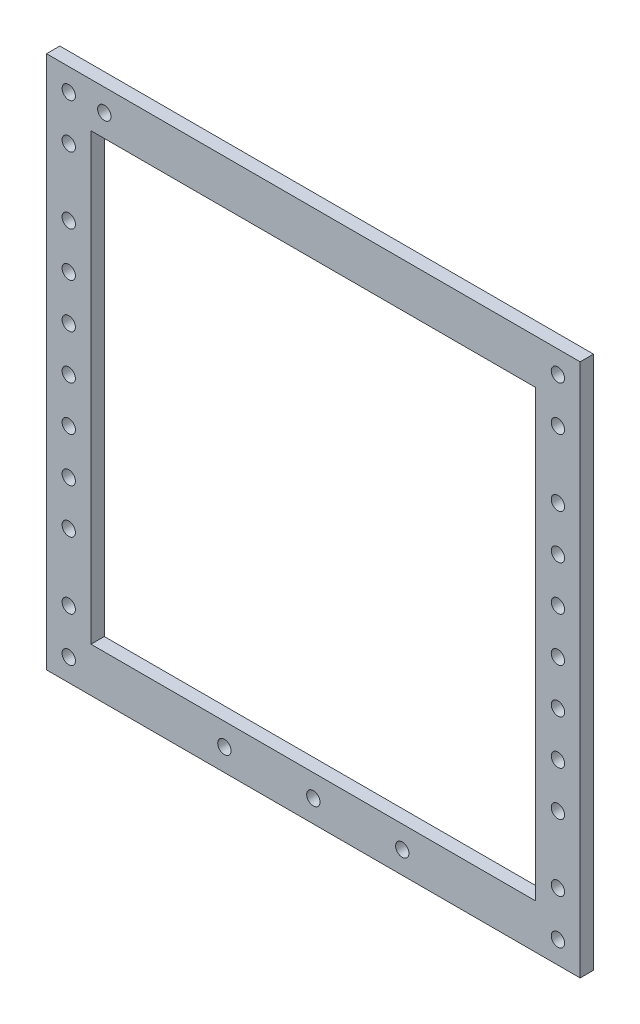
ISO-10303-21;
HEADER;
FILE_DESCRIPTION(('STEP AP214'),'2;1');
FILE_NAME('part.step','',(''),(''),'','','');
FILE_SCHEMA(('AUTOMOTIVE_DESIGN { 1 0 10303 214 1 1 1 1 }'));
ENDSEC;
DATA;
#1=APPLICATION_CONTEXT('core data for automotive mechanical design processes');
#2=APPLICATION_PROTOCOL_DEFINITION('international standard','automotive_design',2000,#1);
#3=PRODUCT_CONTEXT('',#1,'mechanical');
#4=PRODUCT('Part','Part','',(#3));
#5=PRODUCT_RELATED_PRODUCT_CATEGORY('part','',(#4));
#6=PRODUCT_DEFINITION_FORMATION('','',#4);
#7=PRODUCT_DEFINITION_CONTEXT('part definition',#1,'design');
#8=PRODUCT_DEFINITION('design','',#6,#7);
#9=PRODUCT_DEFINITION_SHAPE('','',#8);
#10=(LENGTH_UNIT() NAMED_UNIT(*) SI_UNIT(.MILLI.,.METRE.));
#11=(NAMED_UNIT(*) PLANE_ANGLE_UNIT() SI_UNIT($,.RADIAN.));
#12=(NAMED_UNIT(*) SI_UNIT($,.STERADIAN.) SOLID_ANGLE_UNIT());
#13=UNCERTAINTY_MEASURE_WITH_UNIT(LENGTH_MEASURE(1.E-05),#10,'distance_accuracy_value','');
#14=(GEOMETRIC_REPRESENTATION_CONTEXT(3) GLOBAL_UNCERTAINTY_ASSIGNED_CONTEXT((#13)) GLOBAL_UNIT_ASSIGNED_CONTEXT((#10,
#11,#12)) REPRESENTATION_CONTEXT('',''));
#15=CARTESIAN_POINT('',(0.,0.,0.));
#16=DIRECTION('',(0.,0.,1.));
#17=DIRECTION('',(1.,0.,0.));
#18=AXIS2_PLACEMENT_3D('',#15,#16,#17);
#19=CARTESIAN_POINT('',(-6.52690381404906,6.34615384615385,3.));
#20=DIRECTION('',(1.,0.,0.));
#21=DIRECTION('',(0.,1.,0.));
#22=AXIS2_PLACEMENT_3D('',#19,#20,#21);
#23=PLANE('',#22);
#24=DIRECTION('',(0.,-1.,0.));
#25=VECTOR('',#24,1.);
#26=CARTESIAN_POINT('',(-6.52690381404906,6.34615384615385,0.));
#27=LINE('',#26,#25);
#28=CARTESIAN_POINT('',(-6.52690381404906,6.34615384615385,0.));
#29=VERTEX_POINT('',#28);
#30=CARTESIAN_POINT('',(-6.52690381404904,-113.653846153846,0.));
#31=VERTEX_POINT('',#30);
#32=EDGE_CURVE('E134',#29,#31,#27,.T.);
#33=ORIENTED_EDGE('',*,*,#32,.T.);
#34=DIRECTION('',(0.,0.,-1.));
#35=VECTOR('',#34,1.);
#36=CARTESIAN_POINT('',(-6.52690381404904,-113.653846153846,3.));
#37=LINE('',#36,#35);
#38=CARTESIAN_POINT('',(-6.52690381404904,-113.653846153846,3.));
#39=VERTEX_POINT('',#38);
#40=EDGE_CURVE('E11',#39,#31,#37,.T.);
#41=ORIENTED_EDGE('',*,*,#40,.F.);
#42=DIRECTION('',(0.,-1.,0.));
#43=VECTOR('',#42,1.);
#44=CARTESIAN_POINT('',(-6.52690381404906,6.34615384615385,3.));
#45=LINE('',#44,#43);
#46=CARTESIAN_POINT('',(-6.52690381404906,6.34615384615385,3.));
#47=VERTEX_POINT('',#46);
#48=EDGE_CURVE('E138',#47,#39,#45,.T.);
#49=ORIENTED_EDGE('',*,*,#48,.F.);
#50=DIRECTION('',(0.,0.,-1.));
#51=VECTOR('',#50,1.);
#52=CARTESIAN_POINT('',(-6.52690381404906,6.34615384615385,3.));
#53=LINE('',#52,#51);
#54=EDGE_CURVE('E148',#47,#29,#53,.T.);
#55=ORIENTED_EDGE('',*,*,#54,.T.);
#56=EDGE_LOOP('',(#33,#41,#49,#55));
#57=FACE_BOUND('',#56,.T.);
#58=ADVANCED_FACE('F33',(#57),#23,.F.);
#59=CARTESIAN_POINT('',(-6.52690381404904,-113.653846153846,3.));
#60=DIRECTION('',(0.,1.,0.));
#61=DIRECTION('',(0.,0.,1.));
#62=AXIS2_PLACEMENT_3D('',#59,#60,#61);
#63=PLANE('',#62);
#64=DIRECTION('',(1.,0.,0.));
#65=VECTOR('',#64,1.);
#66=CARTESIAN_POINT('',(-6.52690381404904,-113.653846153846,0.));
#67=LINE('',#66,#65);
#68=CARTESIAN_POINT('',(113.473096185951,-113.653846153846,0.));
#69=VERTEX_POINT('',#68);
#70=EDGE_CURVE('E151',#31,#69,#67,.T.);
#71=ORIENTED_EDGE('',*,*,#70,.T.);
#72=DIRECTION('',(0.,0.,-1.));
#73=VECTOR('',#72,1.);
#74=CARTESIAN_POINT('',(113.473096185951,-113.653846153846,3.));
#75=LINE('',#74,#73);
#76=CARTESIAN_POINT('',(113.473096185951,-113.653846153846,3.));
#77=VERTEX_POINT('',#76);
#78=EDGE_CURVE('E40',#77,#69,#75,.T.);
#79=ORIENTED_EDGE('',*,*,#78,.F.);
#80=DIRECTION('',(1.,0.,0.));
#81=VECTOR('',#80,1.);
#82=CARTESIAN_POINT('',(-6.52690381404904,-113.653846153846,3.));
#83=LINE('',#82,#81);
#84=EDGE_CURVE('E141',#39,#77,#83,.T.);
#85=ORIENTED_EDGE('',*,*,#84,.F.);
#86=ORIENTED_EDGE('',*,*,#40,.T.);
#87=EDGE_LOOP('',(#71,#79,#85,#86));
#88=FACE_BOUND('',#87,.T.);
#89=ADVANCED_FACE('F179',(#88),#63,.F.);
#90=CARTESIAN_POINT('',(113.473096185951,6.34615384615385,3.));
#91=DIRECTION('',(-1.,0.,0.));
#92=DIRECTION('',(0.,-1.,0.));
#93=AXIS2_PLACEMENT_3D('',#90,#91,#92);
#94=PLANE('',#93);
#95=DIRECTION('',(0.,1.,0.));
#96=VECTOR('',#95,1.);
#97=CARTESIAN_POINT('',(113.473096185951,6.34615384615385,0.));
#98=LINE('',#97,#96);
#99=CARTESIAN_POINT('',(113.473096185951,6.34615384615385,0.));
#100=VERTEX_POINT('',#99);
#101=EDGE_CURVE('E153',#69,#100,#98,.T.);
#102=ORIENTED_EDGE('',*,*,#101,.T.);
#103=DIRECTION('',(0.,0.,-1.));
#104=VECTOR('',#103,1.);
#105=CARTESIAN_POINT('',(113.473096185951,6.34615384615385,3.));
#106=LINE('',#105,#104);
#107=CARTESIAN_POINT('',(113.473096185951,6.34615384615385,3.));
#108=VERTEX_POINT('',#107);
#109=EDGE_CURVE('E158',#108,#100,#106,.T.);
#110=ORIENTED_EDGE('',*,*,#109,.F.);
#111=DIRECTION('',(0.,1.,0.));
#112=VECTOR('',#111,1.);
#113=CARTESIAN_POINT('',(113.473096185951,6.34615384615385,3.));
#114=LINE('',#113,#112);
#115=EDGE_CURVE('E144',#77,#108,#114,.T.);
#116=ORIENTED_EDGE('',*,*,#115,.F.);
#117=ORIENTED_EDGE('',*,*,#78,.T.);
#118=EDGE_LOOP('',(#102,#110,#116,#117));
#119=FACE_BOUND('',#118,.T.);
#120=ADVANCED_FACE('F165',(#119),#94,.F.);
#121=CARTESIAN_POINT('',(-6.52690381404906,6.34615384615385,3.));
#122=DIRECTION('',(0.,-1.,0.));
#123=DIRECTION('',(0.,0.,-1.));
#124=AXIS2_PLACEMENT_3D('',#121,#122,#123);
#125=PLANE('',#124);
#126=DIRECTION('',(-1.,0.,0.));
#127=VECTOR('',#126,1.);
#128=CARTESIAN_POINT('',(-6.52690381404906,6.34615384615385,0.));
#129=LINE('',#128,#127);
#130=EDGE_CURVE('E142',#100,#29,#129,.T.);
#131=ORIENTED_EDGE('',*,*,#130,.T.);
#132=ORIENTED_EDGE('',*,*,#54,.F.);
#133=DIRECTION('',(-1.,0.,0.));
#134=VECTOR('',#133,1.);
#135=CARTESIAN_POINT('',(-6.52690381404906,6.34615384615385,3.));
#136=LINE('',#135,#134);
#137=EDGE_CURVE('E146',#108,#47,#136,.T.);
#138=ORIENTED_EDGE('',*,*,#137,.F.);
#139=ORIENTED_EDGE('',*,*,#109,.T.);
#140=EDGE_LOOP('',(#131,#132,#138,#139));
#141=FACE_BOUND('',#140,.T.);
#142=ADVANCED_FACE('F172',(#141),#125,.F.);
#143=CARTESIAN_POINT('',(0.,0.,3.));
#144=DIRECTION('',(0.,0.,1.));
#145=DIRECTION('',(1.,0.,0.));
#146=AXIS2_PLACEMENT_3D('',#143,#144,#145);
#147=PLANE('',#146);
#148=CARTESIAN_POINT('',(-1.52690381404907,-43.6538461538462,3.));
#149=DIRECTION('',(0.,0.,1.));
#150=DIRECTION('',(-1.,0.,0.));
#151=AXIS2_PLACEMENT_3D('',#148,#149,#150);
#152=CIRCLE('',#151,1.5);
#153=CARTESIAN_POINT('',(-3.02690381404907,-43.6538461538462,3.));
#154=VERTEX_POINT('',#153);
#155=EDGE_CURVE('E339',#154,#154,#152,.T.);
#156=ORIENTED_EDGE('',*,*,#155,.F.);
#157=EDGE_LOOP('',(#156));
#158=FACE_BOUND('',#157,.T.);
#159=CARTESIAN_POINT('',(-1.52690381404907,-23.6538461538462,3.));
#160=DIRECTION('',(0.,0.,1.));
#161=DIRECTION('',(-1.,0.,0.));
#162=AXIS2_PLACEMENT_3D('',#159,#160,#161);
#163=CIRCLE('',#162,1.5);
#164=CARTESIAN_POINT('',(-3.02690381404907,-23.6538461538462,3.));
#165=VERTEX_POINT('',#164);
#166=EDGE_CURVE('E345',#165,#165,#163,.T.);
#167=ORIENTED_EDGE('',*,*,#166,.F.);
#168=EDGE_LOOP('',(#167));
#169=FACE_BOUND('',#168,.T.);
#170=CARTESIAN_POINT('',(108.473096185951,-8.65384615384616,3.));
#171=DIRECTION('',(0.,0.,1.));
#172=DIRECTION('',(1.,0.,0.));
#173=AXIS2_PLACEMENT_3D('',#170,#171,#172);
#174=CIRCLE('',#173,1.5);
#175=CARTESIAN_POINT('',(109.973096185951,-8.65384615384616,3.));
#176=VERTEX_POINT('',#175);
#177=EDGE_CURVE('E321',#176,#176,#174,.T.);
#178=ORIENTED_EDGE('',*,*,#177,.F.);
#179=EDGE_LOOP('',(#178));
#180=FACE_BOUND('',#179,.T.);
#181=CARTESIAN_POINT('',(108.473096185951,-98.6538461538462,3.));
#182=DIRECTION('',(0.,0.,1.));
#183=DIRECTION('',(1.,0.,0.));
#184=AXIS2_PLACEMENT_3D('',#181,#182,#183);
#185=CIRCLE('',#184,1.5);
#186=CARTESIAN_POINT('',(109.973096185951,-98.6538461538462,3.));
#187=VERTEX_POINT('',#186);
#188=EDGE_CURVE('E317',#187,#187,#185,.T.);
#189=ORIENTED_EDGE('',*,*,#188,.F.);
#190=EDGE_LOOP('',(#189));
#191=FACE_BOUND('',#190,.T.);
#192=CARTESIAN_POINT('',(-1.52690381404905,-98.6538461538462,3.));
#193=DIRECTION('',(0.,0.,1.));
#194=DIRECTION('',(-1.,0.,0.));
#195=AXIS2_PLACEMENT_3D('',#192,#193,#194);
#196=CIRCLE('',#195,1.5);
#197=CARTESIAN_POINT('',(-3.02690381404904,-98.6538461538462,3.));
#198=VERTEX_POINT('',#197);
#199=EDGE_CURVE('E324',#198,#198,#196,.T.);
#200=ORIENTED_EDGE('',*,*,#199,.F.);
#201=EDGE_LOOP('',(#200));
#202=FACE_BOUND('',#201,.T.);
#203=CARTESIAN_POINT('',(-1.52690381404909,-8.65384615384618,3.));
#204=DIRECTION('',(0.,0.,1.));
#205=DIRECTION('',(-1.,0.,0.));
#206=AXIS2_PLACEMENT_3D('',#203,#204,#205);
#207=CIRCLE('',#206,1.5);
#208=CARTESIAN_POINT('',(-3.02690381404909,-8.65384615384618,3.));
#209=VERTEX_POINT('',#208);
#210=EDGE_CURVE('E332',#209,#209,#207,.T.);
#211=ORIENTED_EDGE('',*,*,#210,.F.);
#212=EDGE_LOOP('',(#211));
#213=FACE_BOUND('',#212,.T.);
#214=CARTESIAN_POINT('',(108.473096185951,-43.6538461538462,3.));
#215=DIRECTION('',(0.,0.,1.));
#216=DIRECTION('',(1.,0.,0.));
#217=AXIS2_PLACEMENT_3D('',#214,#215,#216);
#218=CIRCLE('',#217,1.5);
#219=CARTESIAN_POINT('',(109.973096185951,-43.6538461538462,3.));
#220=VERTEX_POINT('',#219);
#221=EDGE_CURVE('E375',#220,#220,#218,.T.);
#222=ORIENTED_EDGE('',*,*,#221,.F.);
#223=EDGE_LOOP('',(#222));
#224=FACE_BOUND('',#223,.T.);
#225=CARTESIAN_POINT('',(108.473096185951,-63.6538461538462,3.));
#226=DIRECTION('',(0.,0.,1.));
#227=DIRECTION('',(1.,0.,0.));
#228=AXIS2_PLACEMENT_3D('',#225,#226,#227);
#229=CIRCLE('',#228,1.5);
#230=CARTESIAN_POINT('',(109.973096185951,-63.6538461538462,3.));
#231=VERTEX_POINT('',#230);
#232=EDGE_CURVE('E356',#231,#231,#229,.T.);
#233=ORIENTED_EDGE('',*,*,#232,.F.);
#234=EDGE_LOOP('',(#233));
#235=FACE_BOUND('',#234,.T.);
#236=CARTESIAN_POINT('',(108.473096185951,-83.6538461538462,3.));
#237=DIRECTION('',(0.,0.,1.));
#238=DIRECTION('',(1.,0.,0.));
#239=AXIS2_PLACEMENT_3D('',#236,#237,#238);
#240=CIRCLE('',#239,1.5);
#241=CARTESIAN_POINT('',(109.973096185951,-83.6538461538462,3.));
#242=VERTEX_POINT('',#241);
#243=EDGE_CURVE('E357',#242,#242,#240,.T.);
#244=ORIENTED_EDGE('',*,*,#243,.F.);
#245=EDGE_LOOP('',(#244));
#246=FACE_BOUND('',#245,.T.);
#247=CARTESIAN_POINT('',(-1.52690381404906,-83.6538461538462,3.));
#248=DIRECTION('',(0.,0.,1.));
#249=DIRECTION('',(-1.,0.,0.));
#250=AXIS2_PLACEMENT_3D('',#247,#248,#249);
#251=CIRCLE('',#250,1.5);
#252=CARTESIAN_POINT('',(-3.02690381404906,-83.6538461538462,3.));
#253=VERTEX_POINT('',#252);
#254=EDGE_CURVE('E363',#253,#253,#251,.T.);
#255=ORIENTED_EDGE('',*,*,#254,.F.);
#256=EDGE_LOOP('',(#255));
#257=FACE_BOUND('',#256,.T.);
#258=CARTESIAN_POINT('',(-1.52690381404906,-63.6538461538462,3.));
#259=DIRECTION('',(0.,0.,1.));
#260=DIRECTION('',(-1.,0.,0.));
#261=AXIS2_PLACEMENT_3D('',#258,#259,#260);
#262=CIRCLE('',#261,1.5);
#263=CARTESIAN_POINT('',(-3.02690381404906,-63.6538461538462,3.));
#264=VERTEX_POINT('',#263);
#265=EDGE_CURVE('E338',#264,#264,#262,.T.);
#266=ORIENTED_EDGE('',*,*,#265,.F.);
#267=EDGE_LOOP('',(#266));
#268=FACE_BOUND('',#267,.T.);
#269=CARTESIAN_POINT('',(108.473096185951,-23.6538461538462,3.));
#270=DIRECTION('',(0.,0.,1.));
#271=DIRECTION('',(1.,0.,0.));
#272=AXIS2_PLACEMENT_3D('',#269,#270,#271);
#273=CIRCLE('',#272,1.5);
#274=CARTESIAN_POINT('',(109.973096185951,-23.6538461538462,3.));
#275=VERTEX_POINT('',#274);
#276=EDGE_CURVE('E374',#275,#275,#273,.T.);
#277=ORIENTED_EDGE('',*,*,#276,.F.);
#278=EDGE_LOOP('',(#277));
#279=FACE_BOUND('',#278,.T.);
#280=CARTESIAN_POINT('',(53.4730961859509,-108.653846153846,3.));
#281=DIRECTION('',(0.,0.,1.));
#282=DIRECTION('',(1.,0.,0.));
#283=AXIS2_PLACEMENT_3D('',#280,#281,#282);
#284=CIRCLE('',#283,1.5);
#285=CARTESIAN_POINT('',(54.973096185951,-108.653846153846,3.));
#286=VERTEX_POINT('',#285);
#287=EDGE_CURVE('E393',#286,#286,#284,.T.);
#288=ORIENTED_EDGE('',*,*,#287,.F.);
#289=EDGE_LOOP('',(#288));
#290=FACE_BOUND('',#289,.T.);
#291=CARTESIAN_POINT('',(33.4730961859509,-108.653846153846,3.));
#292=DIRECTION('',(0.,0.,1.));
#293=DIRECTION('',(1.,0.,0.));
#294=AXIS2_PLACEMENT_3D('',#291,#292,#293);
#295=CIRCLE('',#294,1.5);
#296=CARTESIAN_POINT('',(34.9730961859509,-108.653846153846,3.));
#297=VERTEX_POINT('',#296);
#298=EDGE_CURVE('E386',#297,#297,#295,.T.);
#299=ORIENTED_EDGE('',*,*,#298,.F.);
#300=EDGE_LOOP('',(#299));
#301=FACE_BOUND('',#300,.T.);
#302=CARTESIAN_POINT('',(73.4730961859509,-108.653846153846,3.));
#303=DIRECTION('',(0.,0.,1.));
#304=DIRECTION('',(1.,0.,0.));
#305=AXIS2_PLACEMENT_3D('',#302,#303,#304);
#306=CIRCLE('',#305,1.5);
#307=CARTESIAN_POINT('',(74.9730961859509,-108.653846153846,3.));
#308=VERTEX_POINT('',#307);
#309=EDGE_CURVE('E392',#308,#308,#306,.T.);
#310=ORIENTED_EDGE('',*,*,#309,.F.);
#311=EDGE_LOOP('',(#310));
#312=FACE_BOUND('',#311,.T.);
#313=CARTESIAN_POINT('',(6.47309618595094,1.34615384615385,3.));
#314=DIRECTION('',(0.,0.,1.));
#315=DIRECTION('',(1.,0.,0.));
#316=AXIS2_PLACEMENT_3D('',#313,#314,#315);
#317=CIRCLE('',#316,1.5);
#318=CARTESIAN_POINT('',(7.97309618595094,1.34615384615385,3.));
#319=VERTEX_POINT('',#318);
#320=EDGE_CURVE('E404',#319,#319,#317,.T.);
#321=ORIENTED_EDGE('',*,*,#320,.F.);
#322=EDGE_LOOP('',(#321));
#323=FACE_BOUND('',#322,.T.);
#324=CARTESIAN_POINT('',(-1.52690381404907,-73.6538461538461,3.));
#325=DIRECTION('',(0.,0.,1.));
#326=DIRECTION('',(1.,0.,0.));
#327=AXIS2_PLACEMENT_3D('',#324,#325,#326);
#328=CIRCLE('',#327,1.5);
#329=CARTESIAN_POINT('',(-0.0269038140490725,-73.6538461538461,3.));
#330=VERTEX_POINT('',#329);
#331=EDGE_CURVE('E423',#330,#330,#328,.T.);
#332=ORIENTED_EDGE('',*,*,#331,.F.);
#333=EDGE_LOOP('',(#332));
#334=FACE_BOUND('',#333,.T.);
#335=CARTESIAN_POINT('',(-1.52690381404906,-53.6538461538462,3.));
#336=DIRECTION('',(0.,0.,1.));
#337=DIRECTION('',(1.,0.,0.));
#338=AXIS2_PLACEMENT_3D('',#335,#336,#337);
#339=CIRCLE('',#338,1.5);
#340=CARTESIAN_POINT('',(-0.0269038140490569,-53.6538461538462,3.));
#341=VERTEX_POINT('',#340);
#342=EDGE_CURVE('E417',#341,#341,#339,.T.);
#343=ORIENTED_EDGE('',*,*,#342,.F.);
#344=EDGE_LOOP('',(#343));
#345=FACE_BOUND('',#344,.T.);
#346=CARTESIAN_POINT('',(-1.52690381404906,-33.6538461538462,3.));
#347=DIRECTION('',(0.,0.,1.));
#348=DIRECTION('',(1.,0.,0.));
#349=AXIS2_PLACEMENT_3D('',#346,#347,#348);
#350=CIRCLE('',#349,1.5);
#351=CARTESIAN_POINT('',(-0.0269038140490569,-33.6538461538462,3.));
#352=VERTEX_POINT('',#351);
#353=EDGE_CURVE('E416',#352,#352,#350,.T.);
#354=ORIENTED_EDGE('',*,*,#353,.F.);
#355=EDGE_LOOP('',(#354));
#356=FACE_BOUND('',#355,.T.);
#357=CARTESIAN_POINT('',(-1.52690381404906,-108.653846153846,3.));
#358=DIRECTION('',(0.,0.,1.));
#359=DIRECTION('',(1.,0.,0.));
#360=AXIS2_PLACEMENT_3D('',#357,#358,#359);
#361=CIRCLE('',#360,1.5);
#362=CARTESIAN_POINT('',(-0.0269038140490586,-108.653846153846,3.));
#363=VERTEX_POINT('',#362);
#364=EDGE_CURVE('E430',#363,#363,#361,.T.);
#365=ORIENTED_EDGE('',*,*,#364,.F.);
#366=EDGE_LOOP('',(#365));
#367=FACE_BOUND('',#366,.T.);
#368=CARTESIAN_POINT('',(108.473096185951,-33.6538461538462,3.));
#369=DIRECTION('',(0.,0.,1.));
#370=DIRECTION('',(-1.,0.,0.));
#371=AXIS2_PLACEMENT_3D('',#368,#369,#370);
#372=CIRCLE('',#371,1.50000000000001);
#373=CARTESIAN_POINT('',(106.973096185951,-33.6538461538462,3.));
#374=VERTEX_POINT('',#373);
#375=EDGE_CURVE('E441',#374,#374,#372,.T.);
#376=ORIENTED_EDGE('',*,*,#375,.F.);
#377=EDGE_LOOP('',(#376));
#378=FACE_BOUND('',#377,.T.);
#379=CARTESIAN_POINT('',(108.473096185951,-108.653846153846,3.));
#380=DIRECTION('',(0.,0.,1.));
#381=DIRECTION('',(-1.,0.,0.));
#382=AXIS2_PLACEMENT_3D('',#379,#380,#381);
#383=CIRCLE('',#382,1.50000000000001);
#384=CARTESIAN_POINT('',(106.973096185951,-108.653846153846,3.));
#385=VERTEX_POINT('',#384);
#386=EDGE_CURVE('E442',#385,#385,#383,.T.);
#387=ORIENTED_EDGE('',*,*,#386,.F.);
#388=EDGE_LOOP('',(#387));
#389=FACE_BOUND('',#388,.T.);
#390=CARTESIAN_POINT('',(108.473096185951,1.34615384615385,3.));
#391=DIRECTION('',(0.,0.,1.));
#392=DIRECTION('',(-1.,0.,0.));
#393=AXIS2_PLACEMENT_3D('',#390,#391,#392);
#394=CIRCLE('',#393,1.50000000000001);
#395=CARTESIAN_POINT('',(106.973096185951,1.34615384615385,3.));
#396=VERTEX_POINT('',#395);
#397=EDGE_CURVE('E410',#396,#396,#394,.T.);
#398=ORIENTED_EDGE('',*,*,#397,.F.);
#399=EDGE_LOOP('',(#398));
#400=FACE_BOUND('',#399,.T.);
#401=CARTESIAN_POINT('',(108.473096185951,-53.6538461538462,3.));
#402=DIRECTION('',(0.,0.,1.));
#403=DIRECTION('',(-1.,0.,0.));
#404=AXIS2_PLACEMENT_3D('',#401,#402,#403);
#405=CIRCLE('',#404,1.50000000000001);
#406=CARTESIAN_POINT('',(106.973096185951,-53.6538461538462,3.));
#407=VERTEX_POINT('',#406);
#408=EDGE_CURVE('E453',#407,#407,#405,.T.);
#409=ORIENTED_EDGE('',*,*,#408,.F.);
#410=EDGE_LOOP('',(#409));
#411=FACE_BOUND('',#410,.T.);
#412=CARTESIAN_POINT('',(108.473096185951,-73.6538461538461,3.));
#413=DIRECTION('',(0.,0.,1.));
#414=DIRECTION('',(-1.,0.,0.));
#415=AXIS2_PLACEMENT_3D('',#412,#413,#414);
#416=CIRCLE('',#415,1.50000000000001);
#417=CARTESIAN_POINT('',(106.973096185951,-73.6538461538461,3.));
#418=VERTEX_POINT('',#417);
#419=EDGE_CURVE('E458',#418,#418,#416,.T.);
#420=ORIENTED_EDGE('',*,*,#419,.F.);
#421=EDGE_LOOP('',(#420));
#422=FACE_BOUND('',#421,.T.);
#423=CARTESIAN_POINT('',(-1.52690381404906,1.34615384615385,3.));
#424=DIRECTION('',(0.,0.,1.));
#425=DIRECTION('',(1.,0.,0.));
#426=AXIS2_PLACEMENT_3D('',#423,#424,#425);
#427=CIRCLE('',#426,1.5);
#428=CARTESIAN_POINT('',(-0.0269038140490593,1.34615384615385,3.));
#429=VERTEX_POINT('',#428);
#430=EDGE_CURVE('E121',#429,#429,#427,.T.);
#431=ORIENTED_EDGE('',*,*,#430,.F.);
#432=EDGE_LOOP('',(#431));
#433=FACE_BOUND('',#432,.T.);
#434=DIRECTION('',(0.,-1.,0.));
#435=VECTOR('',#434,1.);
#436=CARTESIAN_POINT('',(3.47309618595094,-103.653846153846,3.));
#437=LINE('',#436,#435);
#438=CARTESIAN_POINT('',(3.47309618595094,-3.65384615384615,3.));
#439=VERTEX_POINT('',#438);
#440=CARTESIAN_POINT('',(3.47309618595094,-103.653846153846,3.));
#441=VERTEX_POINT('',#440);
#442=EDGE_CURVE('E47',#439,#441,#437,.T.);
#443=ORIENTED_EDGE('',*,*,#442,.F.);
#444=DIRECTION('',(-1.,0.,0.));
#445=VECTOR('',#444,1.);
#446=CARTESIAN_POINT('',(3.47309618595094,-3.65384615384615,3.));
#447=LINE('',#446,#445);
#448=CARTESIAN_POINT('',(103.473096185951,-3.65384615384615,3.));
#449=VERTEX_POINT('',#448);
#450=EDGE_CURVE('E115',#449,#439,#447,.T.);
#451=ORIENTED_EDGE('',*,*,#450,.F.);
#452=DIRECTION('',(0.,1.,0.));
#453=VECTOR('',#452,1.);
#454=CARTESIAN_POINT('',(103.473096185951,-103.653846153846,3.));
#455=LINE('',#454,#453);
#456=CARTESIAN_POINT('',(103.473096185951,-103.653846153846,3.));
#457=VERTEX_POINT('',#456);
#458=EDGE_CURVE('E118',#457,#449,#455,.T.);
#459=ORIENTED_EDGE('',*,*,#458,.F.);
#460=DIRECTION('',(1.,0.,0.));
#461=VECTOR('',#460,1.);
#462=CARTESIAN_POINT('',(3.47309618595094,-103.653846153846,3.));
#463=LINE('',#462,#461);
#464=EDGE_CURVE('E127',#441,#457,#463,.T.);
#465=ORIENTED_EDGE('',*,*,#464,.F.);
#466=EDGE_LOOP('',(#443,#451,#459,#465));
#467=FACE_BOUND('',#466,.T.);
#468=ORIENTED_EDGE('',*,*,#48,.T.);
#469=ORIENTED_EDGE('',*,*,#84,.T.);
#470=ORIENTED_EDGE('',*,*,#115,.T.);
#471=ORIENTED_EDGE('',*,*,#137,.T.);
#472=EDGE_LOOP('',(#468,#469,#470,#471));
#473=FACE_BOUND('',#472,.T.);
#474=ADVANCED_FACE('F178',(#158,#169,#180,#191,#202,#213,#224,#235,#246,#257,#268,#279,#290,
#301,#312,#323,#334,#345,#356,#367,#378,#389,#400,#411,#422,#433,#467,#473),#147,.T.);
#475=CARTESIAN_POINT('',(0.,0.,0.));
#476=DIRECTION('',(0.,0.,1.));
#477=DIRECTION('',(1.,0.,0.));
#478=AXIS2_PLACEMENT_3D('',#475,#476,#477);
#479=PLANE('',#478);
#480=CARTESIAN_POINT('',(-1.52690381404907,-43.6538461538462,0.));
#481=DIRECTION('',(0.,0.,1.));
#482=DIRECTION('',(-1.,0.,0.));
#483=AXIS2_PLACEMENT_3D('',#480,#481,#482);
#484=CIRCLE('',#483,1.5);
#485=CARTESIAN_POINT('',(-3.02690381404907,-43.6538461538462,0.));
#486=VERTEX_POINT('',#485);
#487=EDGE_CURVE('E335',#486,#486,#484,.T.);
#488=ORIENTED_EDGE('',*,*,#487,.T.);
#489=EDGE_LOOP('',(#488));
#490=FACE_BOUND('',#489,.T.);
#491=CARTESIAN_POINT('',(-1.52690381404907,-23.6538461538462,0.));
#492=DIRECTION('',(0.,0.,1.));
#493=DIRECTION('',(-1.,0.,0.));
#494=AXIS2_PLACEMENT_3D('',#491,#492,#493);
#495=CIRCLE('',#494,1.5);
#496=CARTESIAN_POINT('',(-3.02690381404907,-23.6538461538462,0.));
#497=VERTEX_POINT('',#496);
#498=EDGE_CURVE('E342',#497,#497,#495,.T.);
#499=ORIENTED_EDGE('',*,*,#498,.T.);
#500=EDGE_LOOP('',(#499));
#501=FACE_BOUND('',#500,.T.);
#502=CARTESIAN_POINT('',(108.473096185951,-8.65384615384616,0.));
#503=DIRECTION('',(0.,0.,1.));
#504=DIRECTION('',(1.,0.,0.));
#505=AXIS2_PLACEMENT_3D('',#502,#503,#504);
#506=CIRCLE('',#505,1.5);
#507=CARTESIAN_POINT('',(109.973096185951,-8.65384615384616,0.));
#508=VERTEX_POINT('',#507);
#509=EDGE_CURVE('E348',#508,#508,#506,.T.);
#510=ORIENTED_EDGE('',*,*,#509,.T.);
#511=EDGE_LOOP('',(#510));
#512=FACE_BOUND('',#511,.T.);
#513=CARTESIAN_POINT('',(108.473096185951,-98.6538461538462,0.));
#514=DIRECTION('',(0.,0.,1.));
#515=DIRECTION('',(1.,0.,0.));
#516=AXIS2_PLACEMENT_3D('',#513,#514,#515);
#517=CIRCLE('',#516,1.5);
#518=CARTESIAN_POINT('',(109.973096185951,-98.6538461538462,0.));
#519=VERTEX_POINT('',#518);
#520=EDGE_CURVE('E314',#519,#519,#517,.T.);
#521=ORIENTED_EDGE('',*,*,#520,.T.);
#522=EDGE_LOOP('',(#521));
#523=FACE_BOUND('',#522,.T.);
#524=CARTESIAN_POINT('',(-1.52690381404905,-98.6538461538462,0.));
#525=DIRECTION('',(0.,0.,1.));
#526=DIRECTION('',(-1.,0.,0.));
#527=AXIS2_PLACEMENT_3D('',#524,#525,#526);
#528=CIRCLE('',#527,1.5);
#529=CARTESIAN_POINT('',(-3.02690381404904,-98.6538461538462,0.));
#530=VERTEX_POINT('',#529);
#531=EDGE_CURVE('E319',#530,#530,#528,.T.);
#532=ORIENTED_EDGE('',*,*,#531,.T.);
#533=EDGE_LOOP('',(#532));
#534=FACE_BOUND('',#533,.T.);
#535=CARTESIAN_POINT('',(-1.52690381404909,-8.65384615384618,0.));
#536=DIRECTION('',(0.,0.,1.));
#537=DIRECTION('',(-1.,0.,0.));
#538=AXIS2_PLACEMENT_3D('',#535,#536,#537);
#539=CIRCLE('',#538,1.5);
#540=CARTESIAN_POINT('',(-3.02690381404909,-8.65384615384618,0.));
#541=VERTEX_POINT('',#540);
#542=EDGE_CURVE('E329',#541,#541,#539,.T.);
#543=ORIENTED_EDGE('',*,*,#542,.T.);
#544=EDGE_LOOP('',(#543));
#545=FACE_BOUND('',#544,.T.);
#546=CARTESIAN_POINT('',(108.473096185951,-43.6538461538462,0.));
#547=DIRECTION('',(0.,0.,1.));
#548=DIRECTION('',(1.,0.,0.));
#549=AXIS2_PLACEMENT_3D('',#546,#547,#548);
#550=CIRCLE('',#549,1.5);
#551=CARTESIAN_POINT('',(109.973096185951,-43.6538461538462,0.));
#552=VERTEX_POINT('',#551);
#553=EDGE_CURVE('E371',#552,#552,#550,.T.);
#554=ORIENTED_EDGE('',*,*,#553,.T.);
#555=EDGE_LOOP('',(#554));
#556=FACE_BOUND('',#555,.T.);
#557=CARTESIAN_POINT('',(108.473096185951,-63.6538461538462,0.));
#558=DIRECTION('',(0.,0.,1.));
#559=DIRECTION('',(1.,0.,0.));
#560=AXIS2_PLACEMENT_3D('',#557,#558,#559);
#561=CIRCLE('',#560,1.5);
#562=CARTESIAN_POINT('',(109.973096185951,-63.6538461538462,0.));
#563=VERTEX_POINT('',#562);
#564=EDGE_CURVE('E378',#563,#563,#561,.T.);
#565=ORIENTED_EDGE('',*,*,#564,.T.);
#566=EDGE_LOOP('',(#565));
#567=FACE_BOUND('',#566,.T.);
#568=CARTESIAN_POINT('',(108.473096185951,-83.6538461538462,0.));
#569=DIRECTION('',(0.,0.,1.));
#570=DIRECTION('',(1.,0.,0.));
#571=AXIS2_PLACEMENT_3D('',#568,#569,#570);
#572=CIRCLE('',#571,1.5);
#573=CARTESIAN_POINT('',(109.973096185951,-83.6538461538462,0.));
#574=VERTEX_POINT('',#573);
#575=EDGE_CURVE('E353',#574,#574,#572,.T.);
#576=ORIENTED_EDGE('',*,*,#575,.T.);
#577=EDGE_LOOP('',(#576));
#578=FACE_BOUND('',#577,.T.);
#579=CARTESIAN_POINT('',(-1.52690381404906,-83.6538461538462,0.));
#580=DIRECTION('',(0.,0.,1.));
#581=DIRECTION('',(-1.,0.,0.));
#582=AXIS2_PLACEMENT_3D('',#579,#580,#581);
#583=CIRCLE('',#582,1.5);
#584=CARTESIAN_POINT('',(-3.02690381404906,-83.6538461538462,0.));
#585=VERTEX_POINT('',#584);
#586=EDGE_CURVE('E360',#585,#585,#583,.T.);
#587=ORIENTED_EDGE('',*,*,#586,.T.);
#588=EDGE_LOOP('',(#587));
#589=FACE_BOUND('',#588,.T.);
#590=CARTESIAN_POINT('',(-1.52690381404906,-63.6538461538462,0.));
#591=DIRECTION('',(0.,0.,1.));
#592=DIRECTION('',(-1.,0.,0.));
#593=AXIS2_PLACEMENT_3D('',#590,#591,#592);
#594=CIRCLE('',#593,1.5);
#595=CARTESIAN_POINT('',(-3.02690381404906,-63.6538461538462,0.));
#596=VERTEX_POINT('',#595);
#597=EDGE_CURVE('E366',#596,#596,#594,.T.);
#598=ORIENTED_EDGE('',*,*,#597,.T.);
#599=EDGE_LOOP('',(#598));
#600=FACE_BOUND('',#599,.T.);
#601=CARTESIAN_POINT('',(108.473096185951,-23.6538461538462,0.));
#602=DIRECTION('',(0.,0.,1.));
#603=DIRECTION('',(1.,0.,0.));
#604=AXIS2_PLACEMENT_3D('',#601,#602,#603);
#605=CIRCLE('',#604,1.5);
#606=CARTESIAN_POINT('',(109.973096185951,-23.6538461538462,0.));
#607=VERTEX_POINT('',#606);
#608=EDGE_CURVE('E383',#607,#607,#605,.T.);
#609=ORIENTED_EDGE('',*,*,#608,.T.);
#610=EDGE_LOOP('',(#609));
#611=FACE_BOUND('',#610,.T.);
#612=CARTESIAN_POINT('',(53.4730961859509,-108.653846153846,0.));
#613=DIRECTION('',(0.,0.,1.));
#614=DIRECTION('',(1.,0.,0.));
#615=AXIS2_PLACEMENT_3D('',#612,#613,#614);
#616=CIRCLE('',#615,1.5);
#617=CARTESIAN_POINT('',(54.973096185951,-108.653846153846,0.));
#618=VERTEX_POINT('',#617);
#619=EDGE_CURVE('E389',#618,#618,#616,.T.);
#620=ORIENTED_EDGE('',*,*,#619,.T.);
#621=EDGE_LOOP('',(#620));
#622=FACE_BOUND('',#621,.T.);
#623=CARTESIAN_POINT('',(33.4730961859509,-108.653846153846,0.));
#624=DIRECTION('',(0.,0.,1.));
#625=DIRECTION('',(1.,0.,0.));
#626=AXIS2_PLACEMENT_3D('',#623,#624,#625);
#627=CIRCLE('',#626,1.5);
#628=CARTESIAN_POINT('',(34.9730961859509,-108.653846153846,0.));
#629=VERTEX_POINT('',#628);
#630=EDGE_CURVE('E396',#629,#629,#627,.T.);
#631=ORIENTED_EDGE('',*,*,#630,.T.);
#632=EDGE_LOOP('',(#631));
#633=FACE_BOUND('',#632,.T.);
#634=CARTESIAN_POINT('',(73.4730961859509,-108.653846153846,0.));
#635=DIRECTION('',(0.,0.,1.));
#636=DIRECTION('',(1.,0.,0.));
#637=AXIS2_PLACEMENT_3D('',#634,#635,#636);
#638=CIRCLE('',#637,1.5);
#639=CARTESIAN_POINT('',(74.9730961859509,-108.653846153846,0.));
#640=VERTEX_POINT('',#639);
#641=EDGE_CURVE('E401',#640,#640,#638,.T.);
#642=ORIENTED_EDGE('',*,*,#641,.T.);
#643=EDGE_LOOP('',(#642));
#644=FACE_BOUND('',#643,.T.);
#645=CARTESIAN_POINT('',(6.47309618595094,1.34615384615385,0.));
#646=DIRECTION('',(0.,0.,1.));
#647=DIRECTION('',(1.,0.,0.));
#648=AXIS2_PLACEMENT_3D('',#645,#646,#647);
#649=CIRCLE('',#648,1.5);
#650=CARTESIAN_POINT('',(7.97309618595094,1.34615384615385,0.));
#651=VERTEX_POINT('',#650);
#652=EDGE_CURVE('E407',#651,#651,#649,.T.);
#653=ORIENTED_EDGE('',*,*,#652,.T.);
#654=EDGE_LOOP('',(#653));
#655=FACE_BOUND('',#654,.T.);
#656=CARTESIAN_POINT('',(-1.52690381404907,-73.6538461538461,0.));
#657=DIRECTION('',(0.,0.,1.));
#658=DIRECTION('',(1.,0.,0.));
#659=AXIS2_PLACEMENT_3D('',#656,#657,#658);
#660=CIRCLE('',#659,1.5);
#661=CARTESIAN_POINT('',(-0.0269038140490725,-73.6538461538461,0.));
#662=VERTEX_POINT('',#661);
#663=EDGE_CURVE('E420',#662,#662,#660,.T.);
#664=ORIENTED_EDGE('',*,*,#663,.T.);
#665=EDGE_LOOP('',(#664));
#666=FACE_BOUND('',#665,.T.);
#667=CARTESIAN_POINT('',(-1.52690381404906,-53.6538461538462,0.));
#668=DIRECTION('',(0.,0.,1.));
#669=DIRECTION('',(1.,0.,0.));
#670=AXIS2_PLACEMENT_3D('',#667,#668,#669);
#671=CIRCLE('',#670,1.5);
#672=CARTESIAN_POINT('',(-0.0269038140490569,-53.6538461538462,0.));
#673=VERTEX_POINT('',#672);
#674=EDGE_CURVE('E413',#673,#673,#671,.T.);
#675=ORIENTED_EDGE('',*,*,#674,.T.);
#676=EDGE_LOOP('',(#675));
#677=FACE_BOUND('',#676,.T.);
#678=CARTESIAN_POINT('',(-1.52690381404906,-33.6538461538462,0.));
#679=DIRECTION('',(0.,0.,1.));
#680=DIRECTION('',(1.,0.,0.));
#681=AXIS2_PLACEMENT_3D('',#678,#679,#680);
#682=CIRCLE('',#681,1.5);
#683=CARTESIAN_POINT('',(-0.0269038140490569,-33.6538461538462,0.));
#684=VERTEX_POINT('',#683);
#685=EDGE_CURVE('E433',#684,#684,#682,.T.);
#686=ORIENTED_EDGE('',*,*,#685,.T.);
#687=EDGE_LOOP('',(#686));
#688=FACE_BOUND('',#687,.T.);
#689=CARTESIAN_POINT('',(-1.52690381404906,-108.653846153846,0.));
#690=DIRECTION('',(0.,0.,1.));
#691=DIRECTION('',(1.,0.,0.));
#692=AXIS2_PLACEMENT_3D('',#689,#690,#691);
#693=CIRCLE('',#692,1.5);
#694=CARTESIAN_POINT('',(-0.0269038140490586,-108.653846153846,0.));
#695=VERTEX_POINT('',#694);
#696=EDGE_CURVE('E427',#695,#695,#693,.T.);
#697=ORIENTED_EDGE('',*,*,#696,.T.);
#698=EDGE_LOOP('',(#697));
#699=FACE_BOUND('',#698,.T.);
#700=CARTESIAN_POINT('',(108.473096185951,-33.6538461538462,0.));
#701=DIRECTION('',(0.,0.,1.));
#702=DIRECTION('',(-1.,0.,0.));
#703=AXIS2_PLACEMENT_3D('',#700,#701,#702);
#704=CIRCLE('',#703,1.50000000000001);
#705=CARTESIAN_POINT('',(106.973096185951,-33.6538461538462,0.));
#706=VERTEX_POINT('',#705);
#707=EDGE_CURVE('E450',#706,#706,#704,.T.);
#708=ORIENTED_EDGE('',*,*,#707,.T.);
#709=EDGE_LOOP('',(#708));
#710=FACE_BOUND('',#709,.T.);
#711=CARTESIAN_POINT('',(108.473096185951,-108.653846153846,0.));
#712=DIRECTION('',(0.,0.,1.));
#713=DIRECTION('',(-1.,0.,0.));
#714=AXIS2_PLACEMENT_3D('',#711,#712,#713);
#715=CIRCLE('',#714,1.50000000000001);
#716=CARTESIAN_POINT('',(106.973096185951,-108.653846153846,0.));
#717=VERTEX_POINT('',#716);
#718=EDGE_CURVE('E438',#717,#717,#715,.T.);
#719=ORIENTED_EDGE('',*,*,#718,.T.);
#720=EDGE_LOOP('',(#719));
#721=FACE_BOUND('',#720,.T.);
#722=CARTESIAN_POINT('',(108.473096185951,1.34615384615385,0.));
#723=DIRECTION('',(0.,0.,1.));
#724=DIRECTION('',(-1.,0.,0.));
#725=AXIS2_PLACEMENT_3D('',#722,#723,#724);
#726=CIRCLE('',#725,1.50000000000001);
#727=CARTESIAN_POINT('',(106.973096185951,1.34615384615385,0.));
#728=VERTEX_POINT('',#727);
#729=EDGE_CURVE('E445',#728,#728,#726,.T.);
#730=ORIENTED_EDGE('',*,*,#729,.T.);
#731=EDGE_LOOP('',(#730));
#732=FACE_BOUND('',#731,.T.);
#733=CARTESIAN_POINT('',(108.473096185951,-53.6538461538462,0.));
#734=DIRECTION('',(0.,0.,1.));
#735=DIRECTION('',(-1.,0.,0.));
#736=AXIS2_PLACEMENT_3D('',#733,#734,#735);
#737=CIRCLE('',#736,1.50000000000001);
#738=CARTESIAN_POINT('',(106.973096185951,-53.6538461538462,0.));
#739=VERTEX_POINT('',#738);
#740=EDGE_CURVE('E461',#739,#739,#737,.T.);
#741=ORIENTED_EDGE('',*,*,#740,.T.);
#742=EDGE_LOOP('',(#741));
#743=FACE_BOUND('',#742,.T.);
#744=CARTESIAN_POINT('',(108.473096185951,-73.6538461538461,0.));
#745=DIRECTION('',(0.,0.,1.));
#746=DIRECTION('',(-1.,0.,0.));
#747=AXIS2_PLACEMENT_3D('',#744,#745,#746);
#748=CIRCLE('',#747,1.50000000000001);
#749=CARTESIAN_POINT('',(106.973096185951,-73.6538461538461,0.));
#750=VERTEX_POINT('',#749);
#751=EDGE_CURVE('E426',#750,#750,#748,.T.);
#752=ORIENTED_EDGE('',*,*,#751,.T.);
#753=EDGE_LOOP('',(#752));
#754=FACE_BOUND('',#753,.T.);
#755=CARTESIAN_POINT('',(-1.52690381404906,1.34615384615385,0.));
#756=DIRECTION('',(0.,0.,1.));
#757=DIRECTION('',(1.,0.,0.));
#758=AXIS2_PLACEMENT_3D('',#755,#756,#757);
#759=CIRCLE('',#758,1.5);
#760=CARTESIAN_POINT('',(-0.0269038140490593,1.34615384615385,0.));
#761=VERTEX_POINT('',#760);
#762=EDGE_CURVE('E128',#761,#761,#759,.T.);
#763=ORIENTED_EDGE('',*,*,#762,.T.);
#764=EDGE_LOOP('',(#763));
#765=FACE_BOUND('',#764,.T.);
#766=DIRECTION('',(-1.,0.,0.));
#767=VECTOR('',#766,1.);
#768=CARTESIAN_POINT('',(3.47309618595094,-3.65384615384615,0.));
#769=LINE('',#768,#767);
#770=CARTESIAN_POINT('',(103.473096185951,-3.65384615384615,0.));
#771=VERTEX_POINT('',#770);
#772=CARTESIAN_POINT('',(3.47309618595094,-3.65384615384615,0.));
#773=VERTEX_POINT('',#772);
#774=EDGE_CURVE('E105',#771,#773,#769,.T.);
#775=ORIENTED_EDGE('',*,*,#774,.T.);
#776=DIRECTION('',(0.,-1.,0.));
#777=VECTOR('',#776,1.);
#778=CARTESIAN_POINT('',(3.47309618595094,-103.653846153846,0.));
#779=LINE('',#778,#777);
#780=CARTESIAN_POINT('',(3.47309618595094,-103.653846153846,0.));
#781=VERTEX_POINT('',#780);
#782=EDGE_CURVE('E99',#773,#781,#779,.T.);
#783=ORIENTED_EDGE('',*,*,#782,.T.);
#784=DIRECTION('',(1.,0.,0.));
#785=VECTOR('',#784,1.);
#786=CARTESIAN_POINT('',(3.47309618595094,-103.653846153846,0.));
#787=LINE('',#786,#785);
#788=CARTESIAN_POINT('',(103.473096185951,-103.653846153846,0.));
#789=VERTEX_POINT('',#788);
#790=EDGE_CURVE('E108',#781,#789,#787,.T.);
#791=ORIENTED_EDGE('',*,*,#790,.T.);
#792=DIRECTION('',(0.,1.,0.));
#793=VECTOR('',#792,1.);
#794=CARTESIAN_POINT('',(103.473096185951,-103.653846153846,0.));
#795=LINE('',#794,#793);
#796=EDGE_CURVE('E55',#789,#771,#795,.T.);
#797=ORIENTED_EDGE('',*,*,#796,.T.);
#798=EDGE_LOOP('',(#775,#783,#791,#797));
#799=FACE_BOUND('',#798,.T.);
#800=ORIENTED_EDGE('',*,*,#32,.F.);
#801=ORIENTED_EDGE('',*,*,#130,.F.);
#802=ORIENTED_EDGE('',*,*,#101,.F.);
#803=ORIENTED_EDGE('',*,*,#70,.F.);
#804=EDGE_LOOP('',(#800,#801,#802,#803));
#805=FACE_BOUND('',#804,.T.);
#806=ADVANCED_FACE('F112',(#490,#501,#512,#523,#534,#545,#556,#567,#578,#589,#600,#611,#622,
#633,#644,#655,#666,#677,#688,#699,#710,#721,#732,#743,#754,#765,#799,#805),#479,.F.);
#807=CARTESIAN_POINT('',(3.47309618595094,-103.653846153846,0.));
#808=DIRECTION('',(-1.,0.,0.));
#809=DIRECTION('',(0.,0.,1.));
#810=AXIS2_PLACEMENT_3D('',#807,#808,#809);
#811=PLANE('',#810);
#812=ORIENTED_EDGE('',*,*,#442,.T.);
#813=DIRECTION('',(0.,0.,1.));
#814=VECTOR('',#813,1.);
#815=CARTESIAN_POINT('',(3.47309618595094,-103.653846153846,0.));
#816=LINE('',#815,#814);
#817=EDGE_CURVE('E95',#781,#441,#816,.T.);
#818=ORIENTED_EDGE('',*,*,#817,.F.);
#819=ORIENTED_EDGE('',*,*,#782,.F.);
#820=DIRECTION('',(0.,0.,1.));
#821=VECTOR('',#820,1.);
#822=CARTESIAN_POINT('',(3.47309618595094,-3.65384615384615,0.));
#823=LINE('',#822,#821);
#824=EDGE_CURVE('E132',#773,#439,#823,.T.);
#825=ORIENTED_EDGE('',*,*,#824,.T.);
#826=EDGE_LOOP('',(#812,#818,#819,#825));
#827=FACE_BOUND('',#826,.T.);
#828=ADVANCED_FACE('F97',(#827),#811,.F.);
#829=CARTESIAN_POINT('',(3.47309618595094,-3.65384615384615,0.));
#830=DIRECTION('',(0.,1.,0.));
#831=DIRECTION('',(0.,0.,1.));
#832=AXIS2_PLACEMENT_3D('',#829,#830,#831);
#833=PLANE('',#832);
#834=ORIENTED_EDGE('',*,*,#450,.T.);
#835=ORIENTED_EDGE('',*,*,#824,.F.);
#836=ORIENTED_EDGE('',*,*,#774,.F.);
#837=DIRECTION('',(0.,0.,1.));
#838=VECTOR('',#837,1.);
#839=CARTESIAN_POINT('',(103.473096185951,-3.65384615384615,0.));
#840=LINE('',#839,#838);
#841=EDGE_CURVE('E135',#771,#449,#840,.T.);
#842=ORIENTED_EDGE('',*,*,#841,.T.);
#843=EDGE_LOOP('',(#834,#835,#836,#842));
#844=FACE_BOUND('',#843,.T.);
#845=ADVANCED_FACE('F197',(#844),#833,.F.);
#846=CARTESIAN_POINT('',(103.473096185951,-103.653846153846,0.));
#847=DIRECTION('',(1.,0.,0.));
#848=DIRECTION('',(0.,0.,-1.));
#849=AXIS2_PLACEMENT_3D('',#846,#847,#848);
#850=PLANE('',#849);
#851=ORIENTED_EDGE('',*,*,#458,.T.);
#852=ORIENTED_EDGE('',*,*,#841,.F.);
#853=ORIENTED_EDGE('',*,*,#796,.F.);
#854=DIRECTION('',(0.,0.,1.));
#855=VECTOR('',#854,1.);
#856=CARTESIAN_POINT('',(103.473096185951,-103.653846153846,0.));
#857=LINE('',#856,#855);
#858=EDGE_CURVE('E104',#789,#457,#857,.T.);
#859=ORIENTED_EDGE('',*,*,#858,.T.);
#860=EDGE_LOOP('',(#851,#852,#853,#859));
#861=FACE_BOUND('',#860,.T.);
#862=ADVANCED_FACE('F201',(#861),#850,.F.);
#863=CARTESIAN_POINT('',(3.47309618595094,-103.653846153846,0.));
#864=DIRECTION('',(0.,-1.,0.));
#865=DIRECTION('',(0.,0.,-1.));
#866=AXIS2_PLACEMENT_3D('',#863,#864,#865);
#867=PLANE('',#866);
#868=ORIENTED_EDGE('',*,*,#464,.T.);
#869=ORIENTED_EDGE('',*,*,#858,.F.);
#870=ORIENTED_EDGE('',*,*,#790,.F.);
#871=ORIENTED_EDGE('',*,*,#817,.T.);
#872=EDGE_LOOP('',(#868,#869,#870,#871));
#873=FACE_BOUND('',#872,.T.);
#874=ADVANCED_FACE('F109',(#873),#867,.F.);
#875=CARTESIAN_POINT('',(-1.52690381404906,1.34615384615385,0.));
#876=DIRECTION('',(0.,0.,1.));
#877=DIRECTION('',(1.,0.,0.));
#878=AXIS2_PLACEMENT_3D('',#875,#876,#877);
#879=CYLINDRICAL_SURFACE('',#878,1.5);
#880=ORIENTED_EDGE('',*,*,#762,.F.);
#881=EDGE_LOOP('',(#880));
#882=FACE_BOUND('',#881,.T.);
#883=ORIENTED_EDGE('',*,*,#430,.T.);
#884=EDGE_LOOP('',(#883));
#885=FACE_BOUND('',#884,.T.);
#886=ADVANCED_FACE('F200',(#882,#885),#879,.F.);
#887=CARTESIAN_POINT('',(108.473096185951,-73.6538461538461,0.));
#888=DIRECTION('',(0.,0.,1.));
#889=DIRECTION('',(1.,0.,0.));
#890=AXIS2_PLACEMENT_3D('',#887,#888,#889);
#891=CYLINDRICAL_SURFACE('',#890,1.50000000000001);
#892=ORIENTED_EDGE('',*,*,#751,.F.);
#893=EDGE_LOOP('',(#892));
#894=FACE_BOUND('',#893,.T.);
#895=ORIENTED_EDGE('',*,*,#419,.T.);
#896=EDGE_LOOP('',(#895));
#897=FACE_BOUND('',#896,.T.);
#898=ADVANCED_FACE('F209',(#894,#897),#891,.F.);
#899=CARTESIAN_POINT('',(108.473096185951,-53.6538461538462,0.));
#900=DIRECTION('',(0.,0.,1.));
#901=DIRECTION('',(1.,0.,0.));
#902=AXIS2_PLACEMENT_3D('',#899,#900,#901);
#903=CYLINDRICAL_SURFACE('',#902,1.50000000000001);
#904=ORIENTED_EDGE('',*,*,#740,.F.);
#905=EDGE_LOOP('',(#904));
#906=FACE_BOUND('',#905,.T.);
#907=ORIENTED_EDGE('',*,*,#408,.T.);
#908=EDGE_LOOP('',(#907));
#909=FACE_BOUND('',#908,.T.);
#910=ADVANCED_FACE('F211',(#906,#909),#903,.F.);
#911=CARTESIAN_POINT('',(108.473096185951,1.34615384615385,0.));
#912=DIRECTION('',(0.,0.,1.));
#913=DIRECTION('',(1.,0.,0.));
#914=AXIS2_PLACEMENT_3D('',#911,#912,#913);
#915=CYLINDRICAL_SURFACE('',#914,1.50000000000001);
#916=ORIENTED_EDGE('',*,*,#729,.F.);
#917=EDGE_LOOP('',(#916));
#918=FACE_BOUND('',#917,.T.);
#919=ORIENTED_EDGE('',*,*,#397,.T.);
#920=EDGE_LOOP('',(#919));
#921=FACE_BOUND('',#920,.T.);
#922=ADVANCED_FACE('F214',(#918,#921),#915,.F.);
#923=CARTESIAN_POINT('',(108.473096185951,-108.653846153846,0.));
#924=DIRECTION('',(0.,0.,1.));
#925=DIRECTION('',(1.,0.,0.));
#926=AXIS2_PLACEMENT_3D('',#923,#924,#925);
#927=CYLINDRICAL_SURFACE('',#926,1.50000000000001);
#928=ORIENTED_EDGE('',*,*,#718,.F.);
#929=EDGE_LOOP('',(#928));
#930=FACE_BOUND('',#929,.T.);
#931=ORIENTED_EDGE('',*,*,#386,.T.);
#932=EDGE_LOOP('',(#931));
#933=FACE_BOUND('',#932,.T.);
#934=ADVANCED_FACE('F223',(#930,#933),#927,.F.);
#935=CARTESIAN_POINT('',(108.473096185951,-33.6538461538462,0.));
#936=DIRECTION('',(0.,0.,1.));
#937=DIRECTION('',(1.,0.,0.));
#938=AXIS2_PLACEMENT_3D('',#935,#936,#937);
#939=CYLINDRICAL_SURFACE('',#938,1.50000000000001);
#940=ORIENTED_EDGE('',*,*,#707,.F.);
#941=EDGE_LOOP('',(#940));
#942=FACE_BOUND('',#941,.T.);
#943=ORIENTED_EDGE('',*,*,#375,.T.);
#944=EDGE_LOOP('',(#943));
#945=FACE_BOUND('',#944,.T.);
#946=ADVANCED_FACE('F219',(#942,#945),#939,.F.);
#947=CARTESIAN_POINT('',(-1.52690381404906,-108.653846153846,0.));
#948=DIRECTION('',(0.,0.,1.));
#949=DIRECTION('',(1.,0.,0.));
#950=AXIS2_PLACEMENT_3D('',#947,#948,#949);
#951=CYLINDRICAL_SURFACE('',#950,1.5);
#952=ORIENTED_EDGE('',*,*,#696,.F.);
#953=EDGE_LOOP('',(#952));
#954=FACE_BOUND('',#953,.T.);
#955=ORIENTED_EDGE('',*,*,#364,.T.);
#956=EDGE_LOOP('',(#955));
#957=FACE_BOUND('',#956,.T.);
#958=ADVANCED_FACE('F222',(#954,#957),#951,.F.);
#959=CARTESIAN_POINT('',(-1.52690381404906,-33.6538461538462,0.));
#960=DIRECTION('',(0.,0.,1.));
#961=DIRECTION('',(1.,0.,0.));
#962=AXIS2_PLACEMENT_3D('',#959,#960,#961);
#963=CYLINDRICAL_SURFACE('',#962,1.5);
#964=ORIENTED_EDGE('',*,*,#685,.F.);
#965=EDGE_LOOP('',(#964));
#966=FACE_BOUND('',#965,.T.);
#967=ORIENTED_EDGE('',*,*,#353,.T.);
#968=EDGE_LOOP('',(#967));
#969=FACE_BOUND('',#968,.T.);
#970=ADVANCED_FACE('F231',(#966,#969),#963,.F.);
#971=CARTESIAN_POINT('',(-1.52690381404906,-53.6538461538462,0.));
#972=DIRECTION('',(0.,0.,1.));
#973=DIRECTION('',(1.,0.,0.));
#974=AXIS2_PLACEMENT_3D('',#971,#972,#973);
#975=CYLINDRICAL_SURFACE('',#974,1.5);
#976=ORIENTED_EDGE('',*,*,#674,.F.);
#977=EDGE_LOOP('',(#976));
#978=FACE_BOUND('',#977,.T.);
#979=ORIENTED_EDGE('',*,*,#342,.T.);
#980=EDGE_LOOP('',(#979));
#981=FACE_BOUND('',#980,.T.);
#982=ADVANCED_FACE('F234',(#978,#981),#975,.F.);
#983=CARTESIAN_POINT('',(-1.52690381404907,-73.6538461538461,0.));
#984=DIRECTION('',(0.,0.,1.));
#985=DIRECTION('',(1.,0.,0.));
#986=AXIS2_PLACEMENT_3D('',#983,#984,#985);
#987=CYLINDRICAL_SURFACE('',#986,1.5);
#988=ORIENTED_EDGE('',*,*,#663,.F.);
#989=EDGE_LOOP('',(#988));
#990=FACE_BOUND('',#989,.T.);
#991=ORIENTED_EDGE('',*,*,#331,.T.);
#992=EDGE_LOOP('',(#991));
#993=FACE_BOUND('',#992,.T.);
#994=ADVANCED_FACE('F239',(#990,#993),#987,.F.);
#995=CARTESIAN_POINT('',(6.47309618595094,1.34615384615385,0.));
#996=DIRECTION('',(0.,0.,1.));
#997=DIRECTION('',(1.,0.,0.));
#998=AXIS2_PLACEMENT_3D('',#995,#996,#997);
#999=CYLINDRICAL_SURFACE('',#998,1.5);
#1000=ORIENTED_EDGE('',*,*,#652,.F.);
#1001=EDGE_LOOP('',(#1000));
#1002=FACE_BOUND('',#1001,.T.);
#1003=ORIENTED_EDGE('',*,*,#320,.T.);
#1004=EDGE_LOOP('',(#1003));
#1005=FACE_BOUND('',#1004,.T.);
#1006=ADVANCED_FACE('F242',(#1002,#1005),#999,.F.);
#1007=CARTESIAN_POINT('',(73.4730961859509,-108.653846153846,0.));
#1008=DIRECTION('',(0.,0.,1.));
#1009=DIRECTION('',(1.,0.,0.));
#1010=AXIS2_PLACEMENT_3D('',#1007,#1008,#1009);
#1011=CYLINDRICAL_SURFACE('',#1010,1.5);
#1012=ORIENTED_EDGE('',*,*,#641,.F.);
#1013=EDGE_LOOP('',(#1012));
#1014=FACE_BOUND('',#1013,.T.);
#1015=ORIENTED_EDGE('',*,*,#309,.T.);
#1016=EDGE_LOOP('',(#1015));
#1017=FACE_BOUND('',#1016,.T.);
#1018=ADVANCED_FACE('F249',(#1014,#1017),#1011,.F.);
#1019=CARTESIAN_POINT('',(33.4730961859509,-108.653846153846,0.));
#1020=DIRECTION('',(0.,0.,1.));
#1021=DIRECTION('',(1.,0.,0.));
#1022=AXIS2_PLACEMENT_3D('',#1019,#1020,#1021);
#1023=CYLINDRICAL_SURFACE('',#1022,1.5);
#1024=ORIENTED_EDGE('',*,*,#630,.F.);
#1025=EDGE_LOOP('',(#1024));
#1026=FACE_BOUND('',#1025,.T.);
#1027=ORIENTED_EDGE('',*,*,#298,.T.);
#1028=EDGE_LOOP('',(#1027));
#1029=FACE_BOUND('',#1028,.T.);
#1030=ADVANCED_FACE('F253',(#1026,#1029),#1023,.F.);
#1031=CARTESIAN_POINT('',(53.4730961859509,-108.653846153846,0.));
#1032=DIRECTION('',(0.,0.,1.));
#1033=DIRECTION('',(1.,0.,0.));
#1034=AXIS2_PLACEMENT_3D('',#1031,#1032,#1033);
#1035=CYLINDRICAL_SURFACE('',#1034,1.5);
#1036=ORIENTED_EDGE('',*,*,#619,.F.);
#1037=EDGE_LOOP('',(#1036));
#1038=FACE_BOUND('',#1037,.T.);
#1039=ORIENTED_EDGE('',*,*,#287,.T.);
#1040=EDGE_LOOP('',(#1039));
#1041=FACE_BOUND('',#1040,.T.);
#1042=ADVANCED_FACE('F257',(#1038,#1041),#1035,.F.);
#1043=CARTESIAN_POINT('',(108.473096185951,-23.6538461538462,0.));
#1044=DIRECTION('',(0.,0.,1.));
#1045=DIRECTION('',(1.,0.,0.));
#1046=AXIS2_PLACEMENT_3D('',#1043,#1044,#1045);
#1047=CYLINDRICAL_SURFACE('',#1046,1.5);
#1048=ORIENTED_EDGE('',*,*,#608,.F.);
#1049=EDGE_LOOP('',(#1048));
#1050=FACE_BOUND('',#1049,.T.);
#1051=ORIENTED_EDGE('',*,*,#276,.T.);
#1052=EDGE_LOOP('',(#1051));
#1053=FACE_BOUND('',#1052,.T.);
#1054=ADVANCED_FACE('F261',(#1050,#1053),#1047,.F.);
#1055=CARTESIAN_POINT('',(-1.52690381404906,-63.6538461538462,0.));
#1056=DIRECTION('',(0.,0.,1.));
#1057=DIRECTION('',(1.,0.,0.));
#1058=AXIS2_PLACEMENT_3D('',#1055,#1056,#1057);
#1059=CYLINDRICAL_SURFACE('',#1058,1.5);
#1060=ORIENTED_EDGE('',*,*,#597,.F.);
#1061=EDGE_LOOP('',(#1060));
#1062=FACE_BOUND('',#1061,.T.);
#1063=ORIENTED_EDGE('',*,*,#265,.T.);
#1064=EDGE_LOOP('',(#1063));
#1065=FACE_BOUND('',#1064,.T.);
#1066=ADVANCED_FACE('F265',(#1062,#1065),#1059,.F.);
#1067=CARTESIAN_POINT('',(-1.52690381404906,-83.6538461538462,0.));
#1068=DIRECTION('',(0.,0.,1.));
#1069=DIRECTION('',(1.,0.,0.));
#1070=AXIS2_PLACEMENT_3D('',#1067,#1068,#1069);
#1071=CYLINDRICAL_SURFACE('',#1070,1.5);
#1072=ORIENTED_EDGE('',*,*,#586,.F.);
#1073=EDGE_LOOP('',(#1072));
#1074=FACE_BOUND('',#1073,.T.);
#1075=ORIENTED_EDGE('',*,*,#254,.T.);
#1076=EDGE_LOOP('',(#1075));
#1077=FACE_BOUND('',#1076,.T.);
#1078=ADVANCED_FACE('F279',(#1074,#1077),#1071,.F.);
#1079=CARTESIAN_POINT('',(108.473096185951,-83.6538461538462,0.));
#1080=DIRECTION('',(0.,0.,1.));
#1081=DIRECTION('',(1.,0.,0.));
#1082=AXIS2_PLACEMENT_3D('',#1079,#1080,#1081);
#1083=CYLINDRICAL_SURFACE('',#1082,1.5);
#1084=ORIENTED_EDGE('',*,*,#575,.F.);
#1085=EDGE_LOOP('',(#1084));
#1086=FACE_BOUND('',#1085,.T.);
#1087=ORIENTED_EDGE('',*,*,#243,.T.);
#1088=EDGE_LOOP('',(#1087));
#1089=FACE_BOUND('',#1088,.T.);
#1090=ADVANCED_FACE('F271',(#1086,#1089),#1083,.F.);
#1091=CARTESIAN_POINT('',(108.473096185951,-63.6538461538462,0.));
#1092=DIRECTION('',(0.,0.,1.));
#1093=DIRECTION('',(1.,0.,0.));
#1094=AXIS2_PLACEMENT_3D('',#1091,#1092,#1093);
#1095=CYLINDRICAL_SURFACE('',#1094,1.5);
#1096=ORIENTED_EDGE('',*,*,#564,.F.);
#1097=EDGE_LOOP('',(#1096));
#1098=FACE_BOUND('',#1097,.T.);
#1099=ORIENTED_EDGE('',*,*,#232,.T.);
#1100=EDGE_LOOP('',(#1099));
#1101=FACE_BOUND('',#1100,.T.);
#1102=ADVANCED_FACE('F267',(#1098,#1101),#1095,.F.);
#1103=CARTESIAN_POINT('',(108.473096185951,-43.6538461538462,0.));
#1104=DIRECTION('',(0.,0.,1.));
#1105=DIRECTION('',(1.,0.,0.));
#1106=AXIS2_PLACEMENT_3D('',#1103,#1104,#1105);
#1107=CYLINDRICAL_SURFACE('',#1106,1.5);
#1108=ORIENTED_EDGE('',*,*,#553,.F.);
#1109=EDGE_LOOP('',(#1108));
#1110=FACE_BOUND('',#1109,.T.);
#1111=ORIENTED_EDGE('',*,*,#221,.T.);
#1112=EDGE_LOOP('',(#1111));
#1113=FACE_BOUND('',#1112,.T.);
#1114=ADVANCED_FACE('F270',(#1110,#1113),#1107,.F.);
#1115=CARTESIAN_POINT('',(-1.52690381404909,-8.65384615384618,0.));
#1116=DIRECTION('',(0.,0.,1.));
#1117=DIRECTION('',(1.,0.,0.));
#1118=AXIS2_PLACEMENT_3D('',#1115,#1116,#1117);
#1119=CYLINDRICAL_SURFACE('',#1118,1.5);
#1120=ORIENTED_EDGE('',*,*,#542,.F.);
#1121=EDGE_LOOP('',(#1120));
#1122=FACE_BOUND('',#1121,.T.);
#1123=ORIENTED_EDGE('',*,*,#210,.T.);
#1124=EDGE_LOOP('',(#1123));
#1125=FACE_BOUND('',#1124,.T.);
#1126=ADVANCED_FACE('F275',(#1122,#1125),#1119,.F.);
#1127=CARTESIAN_POINT('',(-1.52690381404905,-98.6538461538462,0.));
#1128=DIRECTION('',(0.,0.,1.));
#1129=DIRECTION('',(1.,0.,0.));
#1130=AXIS2_PLACEMENT_3D('',#1127,#1128,#1129);
#1131=CYLINDRICAL_SURFACE('',#1130,1.5);
#1132=ORIENTED_EDGE('',*,*,#531,.F.);
#1133=EDGE_LOOP('',(#1132));
#1134=FACE_BOUND('',#1133,.T.);
#1135=ORIENTED_EDGE('',*,*,#199,.T.);
#1136=EDGE_LOOP('',(#1135));
#1137=FACE_BOUND('',#1136,.T.);
#1138=ADVANCED_FACE('F302',(#1134,#1137),#1131,.F.);
#1139=CARTESIAN_POINT('',(108.473096185951,-98.6538461538462,0.));
#1140=DIRECTION('',(0.,0.,1.));
#1141=DIRECTION('',(1.,0.,0.));
#1142=AXIS2_PLACEMENT_3D('',#1139,#1140,#1141);
#1143=CYLINDRICAL_SURFACE('',#1142,1.5);
#1144=ORIENTED_EDGE('',*,*,#520,.F.);
#1145=EDGE_LOOP('',(#1144));
#1146=FACE_BOUND('',#1145,.T.);
#1147=ORIENTED_EDGE('',*,*,#188,.T.);
#1148=EDGE_LOOP('',(#1147));
#1149=FACE_BOUND('',#1148,.T.);
#1150=ADVANCED_FACE('F291',(#1146,#1149),#1143,.F.);
#1151=CARTESIAN_POINT('',(108.473096185951,-8.65384615384616,0.));
#1152=DIRECTION('',(0.,0.,1.));
#1153=DIRECTION('',(1.,0.,0.));
#1154=AXIS2_PLACEMENT_3D('',#1151,#1152,#1153);
#1155=CYLINDRICAL_SURFACE('',#1154,1.5);
#1156=ORIENTED_EDGE('',*,*,#509,.F.);
#1157=EDGE_LOOP('',(#1156));
#1158=FACE_BOUND('',#1157,.T.);
#1159=ORIENTED_EDGE('',*,*,#177,.T.);
#1160=EDGE_LOOP('',(#1159));
#1161=FACE_BOUND('',#1160,.T.);
#1162=ADVANCED_FACE('F287',(#1158,#1161),#1155,.F.);
#1163=CARTESIAN_POINT('',(-1.52690381404907,-23.6538461538462,0.));
#1164=DIRECTION('',(0.,0.,1.));
#1165=DIRECTION('',(1.,0.,0.));
#1166=AXIS2_PLACEMENT_3D('',#1163,#1164,#1165);
#1167=CYLINDRICAL_SURFACE('',#1166,1.5);
#1168=ORIENTED_EDGE('',*,*,#498,.F.);
#1169=EDGE_LOOP('',(#1168));
#1170=FACE_BOUND('',#1169,.T.);
#1171=ORIENTED_EDGE('',*,*,#166,.T.);
#1172=EDGE_LOOP('',(#1171));
#1173=FACE_BOUND('',#1172,.T.);
#1174=ADVANCED_FACE('F290',(#1170,#1173),#1167,.F.);
#1175=CARTESIAN_POINT('',(-1.52690381404907,-43.6538461538462,0.));
#1176=DIRECTION('',(0.,0.,1.));
#1177=DIRECTION('',(1.,0.,0.));
#1178=AXIS2_PLACEMENT_3D('',#1175,#1176,#1177);
#1179=CYLINDRICAL_SURFACE('',#1178,1.5);
#1180=ORIENTED_EDGE('',*,*,#487,.F.);
#1181=EDGE_LOOP('',(#1180));
#1182=FACE_BOUND('',#1181,.T.);
#1183=ORIENTED_EDGE('',*,*,#155,.T.);
#1184=EDGE_LOOP('',(#1183));
#1185=FACE_BOUND('',#1184,.T.);
#1186=ADVANCED_FACE('F295',(#1182,#1185),#1179,.F.);
#1187=CLOSED_SHELL('',(#58,#89,#120,#142,#474,#806,#828,#845,#862,#874,#886,#898,#910,#922,#934,
#946,#958,#970,#982,#994,#1006,#1018,#1030,#1042,#1054,#1066,#1078,#1090,#1102,#1114,#1126,
#1138,#1150,#1162,#1174,#1186));
#1188=MANIFOLD_SOLID_BREP('B2',#1187);
#1189=ADVANCED_BREP_SHAPE_REPRESENTATION('',(#18,#1188),#14);
#1190=SHAPE_DEFINITION_REPRESENTATION(#9,#1189);
ENDSEC;
END-ISO-10303-21;
